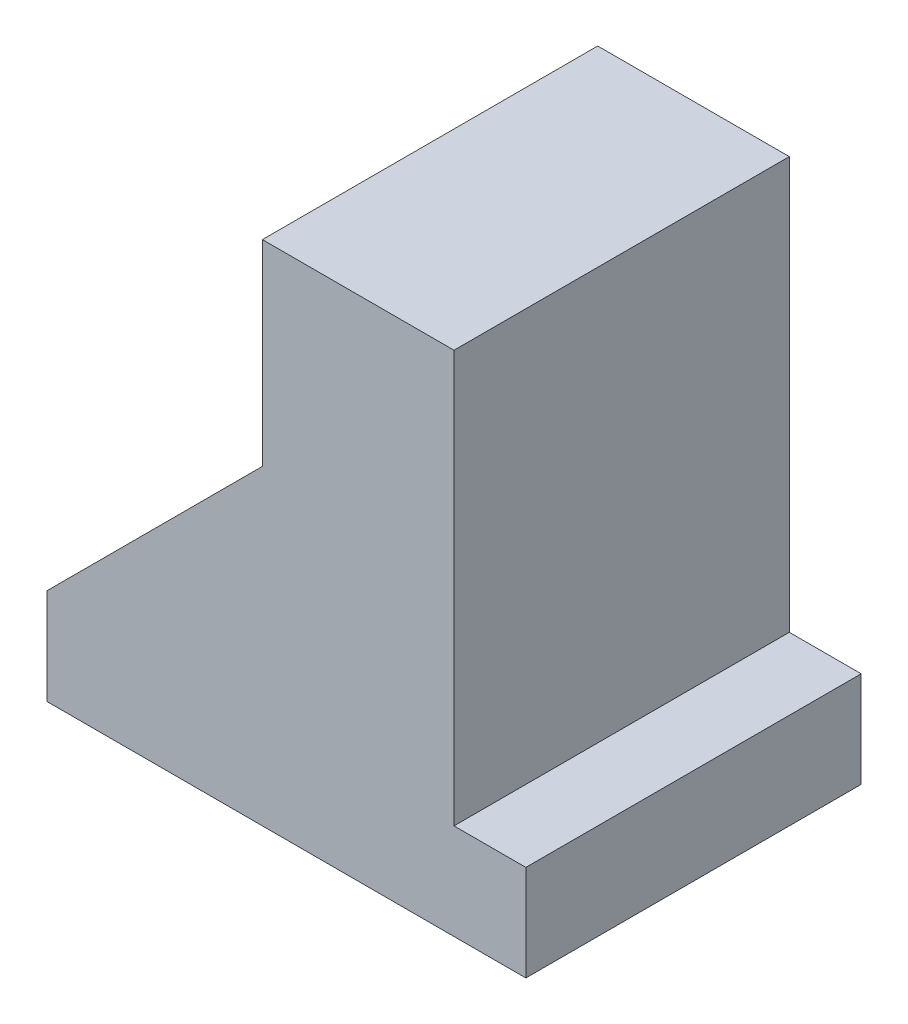
ISO-10303-21;
HEADER;
FILE_DESCRIPTION(('STEP AP214'),'2;1');
FILE_NAME('part.step','',(''),(''),'','','');
FILE_SCHEMA(('AUTOMOTIVE_DESIGN { 1 0 10303 214 1 1 1 1 }'));
ENDSEC;
DATA;
#1=APPLICATION_CONTEXT('core data for automotive mechanical design processes');
#2=APPLICATION_PROTOCOL_DEFINITION('international standard','automotive_design',2000,#1);
#3=PRODUCT_CONTEXT('',#1,'mechanical');
#4=PRODUCT('Part','Part','',(#3));
#5=PRODUCT_RELATED_PRODUCT_CATEGORY('part','',(#4));
#6=PRODUCT_DEFINITION_FORMATION('','',#4);
#7=PRODUCT_DEFINITION_CONTEXT('part definition',#1,'design');
#8=PRODUCT_DEFINITION('design','',#6,#7);
#9=PRODUCT_DEFINITION_SHAPE('','',#8);
#10=(LENGTH_UNIT() NAMED_UNIT(*) SI_UNIT(.MILLI.,.METRE.));
#11=(NAMED_UNIT(*) PLANE_ANGLE_UNIT() SI_UNIT($,.RADIAN.));
#12=(NAMED_UNIT(*) SI_UNIT($,.STERADIAN.) SOLID_ANGLE_UNIT());
#13=UNCERTAINTY_MEASURE_WITH_UNIT(LENGTH_MEASURE(1.E-05),#10,'distance_accuracy_value','');
#14=(GEOMETRIC_REPRESENTATION_CONTEXT(3) GLOBAL_UNCERTAINTY_ASSIGNED_CONTEXT((#13)) GLOBAL_UNIT_ASSIGNED_CONTEXT((#10,
#11,#12)) REPRESENTATION_CONTEXT('',''));
#15=CARTESIAN_POINT('',(0.,0.,0.));
#16=DIRECTION('',(0.,0.,1.));
#17=DIRECTION('',(1.,0.,0.));
#18=AXIS2_PLACEMENT_3D('',#15,#16,#17);
#19=CARTESIAN_POINT('',(0.,2.54,8.89));
#20=DIRECTION('',(1.,0.,0.));
#21=DIRECTION('',(0.,1.,0.));
#22=AXIS2_PLACEMENT_3D('',#19,#20,#21);
#23=PLANE('',#22);
#24=DIRECTION('',(0.,-1.,0.));
#25=VECTOR('',#24,1.);
#26=CARTESIAN_POINT('',(0.,2.54,0.));
#27=LINE('',#26,#25);
#28=CARTESIAN_POINT('',(0.,2.54,0.));
#29=VERTEX_POINT('',#28);
#30=CARTESIAN_POINT('',(0.,0.,0.));
#31=VERTEX_POINT('',#30);
#32=EDGE_CURVE('E129',#29,#31,#27,.T.);
#33=ORIENTED_EDGE('',*,*,#32,.T.);
#34=DIRECTION('',(0.,0.,-1.));
#35=VECTOR('',#34,1.);
#36=CARTESIAN_POINT('',(0.,0.,8.89));
#37=LINE('',#36,#35);
#38=CARTESIAN_POINT('',(0.,0.,8.89));
#39=VERTEX_POINT('',#38);
#40=EDGE_CURVE('E11',#39,#31,#37,.T.);
#41=ORIENTED_EDGE('',*,*,#40,.F.);
#42=DIRECTION('',(0.,-1.,0.));
#43=VECTOR('',#42,1.);
#44=CARTESIAN_POINT('',(0.,2.54,8.89));
#45=LINE('',#44,#43);
#46=CARTESIAN_POINT('',(0.,2.54,8.89));
#47=VERTEX_POINT('',#46);
#48=EDGE_CURVE('E143',#47,#39,#45,.T.);
#49=ORIENTED_EDGE('',*,*,#48,.F.);
#50=DIRECTION('',(0.,0.,-1.));
#51=VECTOR('',#50,1.);
#52=CARTESIAN_POINT('',(0.,2.54,8.89));
#53=LINE('',#52,#51);
#54=EDGE_CURVE('E125',#47,#29,#53,.T.);
#55=ORIENTED_EDGE('',*,*,#54,.T.);
#56=EDGE_LOOP('',(#33,#41,#49,#55));
#57=FACE_BOUND('',#56,.T.);
#58=ADVANCED_FACE('F33',(#57),#23,.F.);
#59=CARTESIAN_POINT('',(0.,0.,8.89));
#60=DIRECTION('',(0.,1.,0.));
#61=DIRECTION('',(0.,0.,1.));
#62=AXIS2_PLACEMENT_3D('',#59,#60,#61);
#63=PLANE('',#62);
#64=DIRECTION('',(1.,0.,0.));
#65=VECTOR('',#64,1.);
#66=CARTESIAN_POINT('',(0.,0.,0.));
#67=LINE('',#66,#65);
#68=CARTESIAN_POINT('',(12.7,0.,0.));
#69=VERTEX_POINT('',#68);
#70=EDGE_CURVE('E132',#31,#69,#67,.T.);
#71=ORIENTED_EDGE('',*,*,#70,.T.);
#72=DIRECTION('',(0.,0.,-1.));
#73=VECTOR('',#72,1.);
#74=CARTESIAN_POINT('',(12.7,0.,8.89));
#75=LINE('',#74,#73);
#76=CARTESIAN_POINT('',(12.7,0.,8.89));
#77=VERTEX_POINT('',#76);
#78=EDGE_CURVE('E41',#77,#69,#75,.T.);
#79=ORIENTED_EDGE('',*,*,#78,.F.);
#80=DIRECTION('',(1.,0.,0.));
#81=VECTOR('',#80,1.);
#82=CARTESIAN_POINT('',(0.,0.,8.89));
#83=LINE('',#82,#81);
#84=EDGE_CURVE('E92',#39,#77,#83,.T.);
#85=ORIENTED_EDGE('',*,*,#84,.F.);
#86=ORIENTED_EDGE('',*,*,#40,.T.);
#87=EDGE_LOOP('',(#71,#79,#85,#86));
#88=FACE_BOUND('',#87,.T.);
#89=ADVANCED_FACE('F178',(#88),#63,.F.);
#90=CARTESIAN_POINT('',(12.7,0.,8.89));
#91=DIRECTION('',(-1.,0.,0.));
#92=DIRECTION('',(0.,0.,1.));
#93=AXIS2_PLACEMENT_3D('',#90,#91,#92);
#94=PLANE('',#93);
#95=DIRECTION('',(0.,1.,0.));
#96=VECTOR('',#95,1.);
#97=CARTESIAN_POINT('',(12.7,0.,0.));
#98=LINE('',#97,#96);
#99=CARTESIAN_POINT('',(12.7,2.54,0.));
#100=VERTEX_POINT('',#99);
#101=EDGE_CURVE('E134',#69,#100,#98,.T.);
#102=ORIENTED_EDGE('',*,*,#101,.T.);
#103=DIRECTION('',(0.,0.,-1.));
#104=VECTOR('',#103,1.);
#105=CARTESIAN_POINT('',(12.7,2.54,8.89));
#106=LINE('',#105,#104);
#107=CARTESIAN_POINT('',(12.7,2.54,8.89));
#108=VERTEX_POINT('',#107);
#109=EDGE_CURVE('E150',#108,#100,#106,.T.);
#110=ORIENTED_EDGE('',*,*,#109,.F.);
#111=DIRECTION('',(0.,1.,0.));
#112=VECTOR('',#111,1.);
#113=CARTESIAN_POINT('',(12.7,0.,8.89));
#114=LINE('',#113,#112);
#115=EDGE_CURVE('E158',#77,#108,#114,.T.);
#116=ORIENTED_EDGE('',*,*,#115,.F.);
#117=ORIENTED_EDGE('',*,*,#78,.T.);
#118=EDGE_LOOP('',(#102,#110,#116,#117));
#119=FACE_BOUND('',#118,.T.);
#120=ADVANCED_FACE('F156',(#119),#94,.F.);
#121=CARTESIAN_POINT('',(12.7,2.54,8.89));
#122=DIRECTION('',(0.,-1.,0.));
#123=DIRECTION('',(1.,0.,0.));
#124=AXIS2_PLACEMENT_3D('',#121,#122,#123);
#125=PLANE('',#124);
#126=DIRECTION('',(-1.,0.,0.));
#127=VECTOR('',#126,1.);
#128=CARTESIAN_POINT('',(12.7,2.54,0.));
#129=LINE('',#128,#127);
#130=CARTESIAN_POINT('',(10.795,2.54,0.));
#131=VERTEX_POINT('',#130);
#132=EDGE_CURVE('E136',#100,#131,#129,.T.);
#133=ORIENTED_EDGE('',*,*,#132,.T.);
#134=DIRECTION('',(0.,0.,-1.));
#135=VECTOR('',#134,1.);
#136=CARTESIAN_POINT('',(10.795,2.54,8.89));
#137=LINE('',#136,#135);
#138=CARTESIAN_POINT('',(10.795,2.54,8.89));
#139=VERTEX_POINT('',#138);
#140=EDGE_CURVE('E147',#139,#131,#137,.T.);
#141=ORIENTED_EDGE('',*,*,#140,.F.);
#142=DIRECTION('',(-1.,0.,0.));
#143=VECTOR('',#142,1.);
#144=CARTESIAN_POINT('',(12.7,2.54,8.89));
#145=LINE('',#144,#143);
#146=EDGE_CURVE('E170',#108,#139,#145,.T.);
#147=ORIENTED_EDGE('',*,*,#146,.F.);
#148=ORIENTED_EDGE('',*,*,#109,.T.);
#149=EDGE_LOOP('',(#133,#141,#147,#148));
#150=FACE_BOUND('',#149,.T.);
#151=ADVANCED_FACE('F166',(#150),#125,.F.);
#152=CARTESIAN_POINT('',(10.795,2.54,8.89));
#153=DIRECTION('',(-1.,0.,0.));
#154=DIRECTION('',(0.,0.,1.));
#155=AXIS2_PLACEMENT_3D('',#152,#153,#154);
#156=PLANE('',#155);
#157=DIRECTION('',(0.,1.,0.));
#158=VECTOR('',#157,1.);
#159=CARTESIAN_POINT('',(10.795,2.54,0.));
#160=LINE('',#159,#158);
#161=CARTESIAN_POINT('',(10.795,13.462,0.));
#162=VERTEX_POINT('',#161);
#163=EDGE_CURVE('E138',#131,#162,#160,.T.);
#164=ORIENTED_EDGE('',*,*,#163,.T.);
#165=DIRECTION('',(0.,0.,-1.));
#166=VECTOR('',#165,1.);
#167=CARTESIAN_POINT('',(10.795,13.462,8.89));
#168=LINE('',#167,#166);
#169=CARTESIAN_POINT('',(10.795,13.462,8.89));
#170=VERTEX_POINT('',#169);
#171=EDGE_CURVE('E120',#170,#162,#168,.T.);
#172=ORIENTED_EDGE('',*,*,#171,.F.);
#173=DIRECTION('',(0.,1.,0.));
#174=VECTOR('',#173,1.);
#175=CARTESIAN_POINT('',(10.795,2.54,8.89));
#176=LINE('',#175,#174);
#177=EDGE_CURVE('E111',#139,#170,#176,.T.);
#178=ORIENTED_EDGE('',*,*,#177,.F.);
#179=ORIENTED_EDGE('',*,*,#140,.T.);
#180=EDGE_LOOP('',(#164,#172,#178,#179));
#181=FACE_BOUND('',#180,.T.);
#182=ADVANCED_FACE('F169',(#181),#156,.F.);
#183=CARTESIAN_POINT('',(10.795,13.462,8.89));
#184=DIRECTION('',(0.,-1.,0.));
#185=DIRECTION('',(0.,0.,-1.));
#186=AXIS2_PLACEMENT_3D('',#183,#184,#185);
#187=PLANE('',#186);
#188=DIRECTION('',(-1.,0.,0.));
#189=VECTOR('',#188,1.);
#190=CARTESIAN_POINT('',(10.795,13.462,0.));
#191=LINE('',#190,#189);
#192=CARTESIAN_POINT('',(5.715,13.462,0.));
#193=VERTEX_POINT('',#192);
#194=EDGE_CURVE('E119',#162,#193,#191,.T.);
#195=ORIENTED_EDGE('',*,*,#194,.T.);
#196=DIRECTION('',(0.,0.,-1.));
#197=VECTOR('',#196,1.);
#198=CARTESIAN_POINT('',(5.715,13.462,8.89));
#199=LINE('',#198,#197);
#200=CARTESIAN_POINT('',(5.715,13.462,8.89));
#201=VERTEX_POINT('',#200);
#202=EDGE_CURVE('E116',#201,#193,#199,.T.);
#203=ORIENTED_EDGE('',*,*,#202,.F.);
#204=DIRECTION('',(-1.,0.,0.));
#205=VECTOR('',#204,1.);
#206=CARTESIAN_POINT('',(10.795,13.462,8.89));
#207=LINE('',#206,#205);
#208=EDGE_CURVE('E105',#170,#201,#207,.T.);
#209=ORIENTED_EDGE('',*,*,#208,.F.);
#210=ORIENTED_EDGE('',*,*,#171,.T.);
#211=EDGE_LOOP('',(#195,#203,#209,#210));
#212=FACE_BOUND('',#211,.T.);
#213=ADVANCED_FACE('F117',(#212),#187,.F.);
#214=CARTESIAN_POINT('',(5.715,13.462,8.89));
#215=DIRECTION('',(1.,0.,0.));
#216=DIRECTION('',(0.,1.,0.));
#217=AXIS2_PLACEMENT_3D('',#214,#215,#216);
#218=PLANE('',#217);
#219=DIRECTION('',(0.,-1.,0.));
#220=VECTOR('',#219,1.);
#221=CARTESIAN_POINT('',(5.715,13.462,0.));
#222=LINE('',#221,#220);
#223=CARTESIAN_POINT('',(5.715,8.25499999999994,0.));
#224=VERTEX_POINT('',#223);
#225=EDGE_CURVE('E78',#193,#224,#222,.T.);
#226=ORIENTED_EDGE('',*,*,#225,.T.);
#227=DIRECTION('',(0.,0.,-1.));
#228=VECTOR('',#227,1.);
#229=CARTESIAN_POINT('',(5.715,8.25499999999994,8.89));
#230=LINE('',#229,#228);
#231=CARTESIAN_POINT('',(5.715,8.25499999999994,8.89));
#232=VERTEX_POINT('',#231);
#233=EDGE_CURVE('E121',#232,#224,#230,.T.);
#234=ORIENTED_EDGE('',*,*,#233,.F.);
#235=DIRECTION('',(0.,-1.,0.));
#236=VECTOR('',#235,1.);
#237=CARTESIAN_POINT('',(5.715,13.462,8.89));
#238=LINE('',#237,#236);
#239=EDGE_CURVE('E109',#201,#232,#238,.T.);
#240=ORIENTED_EDGE('',*,*,#239,.F.);
#241=ORIENTED_EDGE('',*,*,#202,.T.);
#242=EDGE_LOOP('',(#226,#234,#240,#241));
#243=FACE_BOUND('',#242,.T.);
#244=ADVANCED_FACE('F123',(#243),#218,.F.);
#245=CARTESIAN_POINT('',(5.715,8.25499999999994,8.89));
#246=DIRECTION('',(0.707106781186544,-0.707106781186551,0.));
#247=DIRECTION('',(0.707106781186551,0.707106781186544,0.));
#248=AXIS2_PLACEMENT_3D('',#245,#246,#247);
#249=PLANE('',#248);
#250=DIRECTION('',(-0.707106781186551,-0.707106781186544,0.));
#251=VECTOR('',#250,1.);
#252=CARTESIAN_POINT('',(5.715,8.25499999999994,0.));
#253=LINE('',#252,#251);
#254=EDGE_CURVE('E84',#224,#29,#253,.T.);
#255=ORIENTED_EDGE('',*,*,#254,.T.);
#256=ORIENTED_EDGE('',*,*,#54,.F.);
#257=DIRECTION('',(-0.707106781186551,-0.707106781186544,0.));
#258=VECTOR('',#257,1.);
#259=CARTESIAN_POINT('',(5.715,8.25499999999994,8.89));
#260=LINE('',#259,#258);
#261=EDGE_CURVE('E49',#232,#47,#260,.T.);
#262=ORIENTED_EDGE('',*,*,#261,.F.);
#263=ORIENTED_EDGE('',*,*,#233,.T.);
#264=EDGE_LOOP('',(#255,#256,#262,#263));
#265=FACE_BOUND('',#264,.T.);
#266=ADVANCED_FACE('F194',(#265),#249,.F.);
#267=CARTESIAN_POINT('',(0.,0.,8.89));
#268=DIRECTION('',(0.,0.,1.));
#269=DIRECTION('',(1.,0.,0.));
#270=AXIS2_PLACEMENT_3D('',#267,#268,#269);
#271=PLANE('',#270);
#272=ORIENTED_EDGE('',*,*,#48,.T.);
#273=ORIENTED_EDGE('',*,*,#84,.T.);
#274=ORIENTED_EDGE('',*,*,#115,.T.);
#275=ORIENTED_EDGE('',*,*,#146,.T.);
#276=ORIENTED_EDGE('',*,*,#177,.T.);
#277=ORIENTED_EDGE('',*,*,#208,.T.);
#278=ORIENTED_EDGE('',*,*,#239,.T.);
#279=ORIENTED_EDGE('',*,*,#261,.T.);
#280=EDGE_LOOP('',(#272,#273,#274,#275,#276,#277,#278,#279));
#281=FACE_BOUND('',#280,.T.);
#282=ADVANCED_FACE('F107',(#281),#271,.T.);
#283=CARTESIAN_POINT('',(0.,0.,0.));
#284=DIRECTION('',(0.,0.,1.));
#285=DIRECTION('',(1.,0.,0.));
#286=AXIS2_PLACEMENT_3D('',#283,#284,#285);
#287=PLANE('',#286);
#288=ORIENTED_EDGE('',*,*,#32,.F.);
#289=ORIENTED_EDGE('',*,*,#254,.F.);
#290=ORIENTED_EDGE('',*,*,#225,.F.);
#291=ORIENTED_EDGE('',*,*,#194,.F.);
#292=ORIENTED_EDGE('',*,*,#163,.F.);
#293=ORIENTED_EDGE('',*,*,#132,.F.);
#294=ORIENTED_EDGE('',*,*,#101,.F.);
#295=ORIENTED_EDGE('',*,*,#70,.F.);
#296=EDGE_LOOP('',(#288,#289,#290,#291,#292,#293,#294,#295));
#297=FACE_BOUND('',#296,.T.);
#298=ADVANCED_FACE('F162',(#297),#287,.F.);
#299=CLOSED_SHELL('',(#58,#89,#120,#151,#182,#213,#244,#266,#282,#298));
#300=MANIFOLD_SOLID_BREP('B2',#299);
#301=ADVANCED_BREP_SHAPE_REPRESENTATION('',(#18,#300),#14);
#302=SHAPE_DEFINITION_REPRESENTATION(#9,#301);
ENDSEC;
END-ISO-10303-21;
